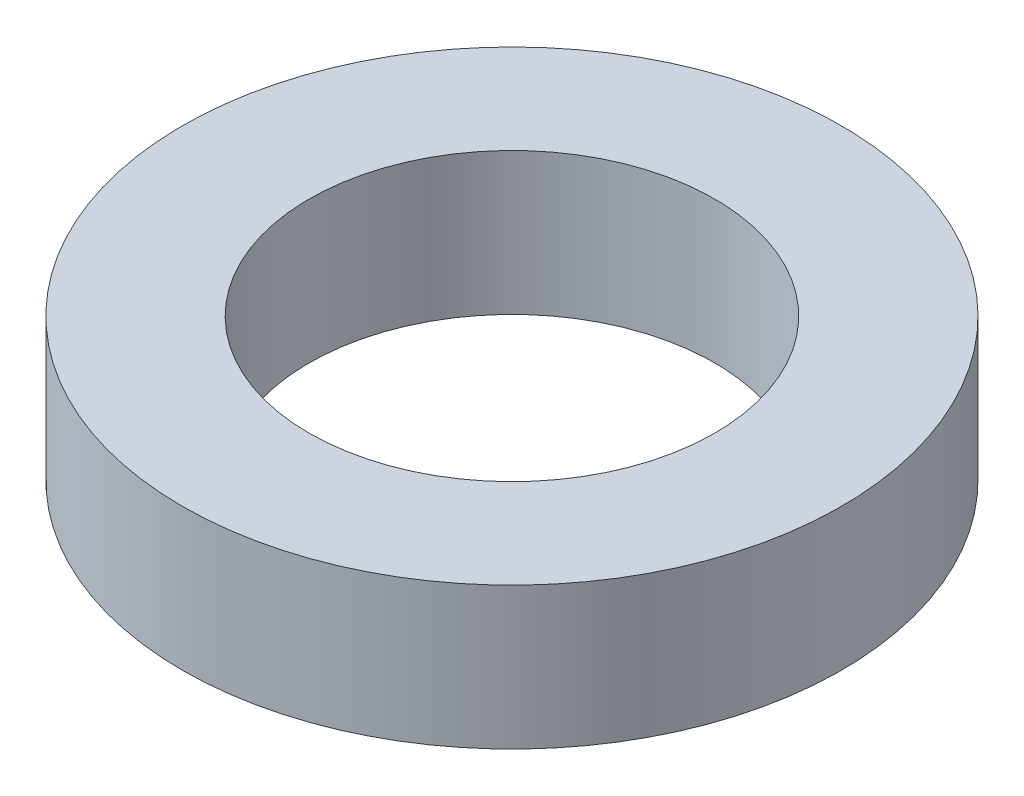
ISO-10303-21;
HEADER;
FILE_DESCRIPTION(('STEP AP214'),'2;1');
FILE_NAME('part.step','',(''),(''),'','','');
FILE_SCHEMA(('AUTOMOTIVE_DESIGN { 1 0 10303 214 1 1 1 1 }'));
ENDSEC;
DATA;
#1=APPLICATION_CONTEXT('core data for automotive mechanical design processes');
#2=APPLICATION_PROTOCOL_DEFINITION('international standard','automotive_design',2000,#1);
#3=PRODUCT_CONTEXT('',#1,'mechanical');
#4=PRODUCT('Part','Part','',(#3));
#5=PRODUCT_RELATED_PRODUCT_CATEGORY('part','',(#4));
#6=PRODUCT_DEFINITION_FORMATION('','',#4);
#7=PRODUCT_DEFINITION_CONTEXT('part definition',#1,'design');
#8=PRODUCT_DEFINITION('design','',#6,#7);
#9=PRODUCT_DEFINITION_SHAPE('','',#8);
#10=(LENGTH_UNIT() NAMED_UNIT(*) SI_UNIT(.MILLI.,.METRE.));
#11=(NAMED_UNIT(*) PLANE_ANGLE_UNIT() SI_UNIT($,.RADIAN.));
#12=(NAMED_UNIT(*) SI_UNIT($,.STERADIAN.) SOLID_ANGLE_UNIT());
#13=UNCERTAINTY_MEASURE_WITH_UNIT(LENGTH_MEASURE(1.E-05),#10,'distance_accuracy_value','');
#14=(GEOMETRIC_REPRESENTATION_CONTEXT(3) GLOBAL_UNCERTAINTY_ASSIGNED_CONTEXT((#13)) GLOBAL_UNIT_ASSIGNED_CONTEXT((#10,
#11,#12)) REPRESENTATION_CONTEXT('',''));
#15=CARTESIAN_POINT('',(0.,0.,0.));
#16=DIRECTION('',(0.,0.,1.));
#17=DIRECTION('',(1.,0.,0.));
#18=AXIS2_PLACEMENT_3D('',#15,#16,#17);
#19=CARTESIAN_POINT('',(0.,28.,0.));
#20=DIRECTION('',(0.,-1.,0.));
#21=DIRECTION('',(0.,0.,-1.));
#22=AXIS2_PLACEMENT_3D('',#19,#20,#21);
#23=CYLINDRICAL_SURFACE('',#22,65.);
#24=CARTESIAN_POINT('',(0.,28.,0.));
#25=DIRECTION('',(0.,1.,0.));
#26=DIRECTION('',(0.,0.,1.));
#27=AXIS2_PLACEMENT_3D('',#24,#25,#26);
#28=CIRCLE('',#27,65.);
#29=CARTESIAN_POINT('',(0.,28.,65.));
#30=VERTEX_POINT('',#29);
#31=EDGE_CURVE('E10',#30,#30,#28,.T.);
#32=ORIENTED_EDGE('',*,*,#31,.F.);
#33=EDGE_LOOP('',(#32));
#34=FACE_BOUND('',#33,.T.);
#35=CARTESIAN_POINT('',(0.,0.,0.));
#36=DIRECTION('',(0.,1.,0.));
#37=DIRECTION('',(0.,0.,1.));
#38=AXIS2_PLACEMENT_3D('',#35,#36,#37);
#39=CIRCLE('',#38,65.);
#40=CARTESIAN_POINT('',(0.,0.,65.));
#41=VERTEX_POINT('',#40);
#42=EDGE_CURVE('E37',#41,#41,#39,.T.);
#43=ORIENTED_EDGE('',*,*,#42,.T.);
#44=EDGE_LOOP('',(#43));
#45=FACE_BOUND('',#44,.T.);
#46=ADVANCED_FACE('F40',(#34,#45),#23,.T.);
#47=CARTESIAN_POINT('',(0.,28.,0.));
#48=DIRECTION('',(0.,1.,0.));
#49=DIRECTION('',(0.,0.,1.));
#50=AXIS2_PLACEMENT_3D('',#47,#48,#49);
#51=PLANE('',#50);
#52=CARTESIAN_POINT('',(0.,28.,0.));
#53=DIRECTION('',(0.,1.,0.));
#54=DIRECTION('',(0.,0.,1.));
#55=AXIS2_PLACEMENT_3D('',#52,#53,#54);
#56=CIRCLE('',#55,40.);
#57=CARTESIAN_POINT('',(0.,28.,40.));
#58=VERTEX_POINT('',#57);
#59=EDGE_CURVE('E50',#58,#58,#56,.T.);
#60=ORIENTED_EDGE('',*,*,#59,.F.);
#61=EDGE_LOOP('',(#60));
#62=FACE_BOUND('',#61,.T.);
#63=ORIENTED_EDGE('',*,*,#31,.T.);
#64=EDGE_LOOP('',(#63));
#65=FACE_BOUND('',#64,.T.);
#66=ADVANCED_FACE('F59',(#62,#65),#51,.T.);
#67=CARTESIAN_POINT('',(0.,0.,0.));
#68=DIRECTION('',(0.,1.,0.));
#69=DIRECTION('',(0.,0.,1.));
#70=AXIS2_PLACEMENT_3D('',#67,#68,#69);
#71=PLANE('',#70);
#72=CARTESIAN_POINT('',(0.,0.,0.));
#73=DIRECTION('',(0.,1.,0.));
#74=DIRECTION('',(0.,0.,1.));
#75=AXIS2_PLACEMENT_3D('',#72,#73,#74);
#76=CIRCLE('',#75,40.);
#77=CARTESIAN_POINT('',(0.,0.,40.));
#78=VERTEX_POINT('',#77);
#79=EDGE_CURVE('E47',#78,#78,#76,.T.);
#80=ORIENTED_EDGE('',*,*,#79,.T.);
#81=EDGE_LOOP('',(#80));
#82=FACE_BOUND('',#81,.T.);
#83=ORIENTED_EDGE('',*,*,#42,.F.);
#84=EDGE_LOOP('',(#83));
#85=FACE_BOUND('',#84,.T.);
#86=ADVANCED_FACE('F58',(#82,#85),#71,.F.);
#87=CARTESIAN_POINT('',(0.,28.,0.));
#88=DIRECTION('',(0.,-1.,0.));
#89=DIRECTION('',(0.,0.,-1.));
#90=AXIS2_PLACEMENT_3D('',#87,#88,#89);
#91=CYLINDRICAL_SURFACE('',#90,40.);
#92=ORIENTED_EDGE('',*,*,#59,.T.);
#93=EDGE_LOOP('',(#92));
#94=FACE_BOUND('',#93,.T.);
#95=ORIENTED_EDGE('',*,*,#79,.F.);
#96=EDGE_LOOP('',(#95));
#97=FACE_BOUND('',#96,.T.);
#98=ADVANCED_FACE('F54',(#94,#97),#91,.F.);
#99=CLOSED_SHELL('',(#46,#66,#86,#98));
#100=MANIFOLD_SOLID_BREP('B2',#99);
#101=ADVANCED_BREP_SHAPE_REPRESENTATION('',(#18,#100),#14);
#102=SHAPE_DEFINITION_REPRESENTATION(#9,#101);
ENDSEC;
END-ISO-10303-21;
